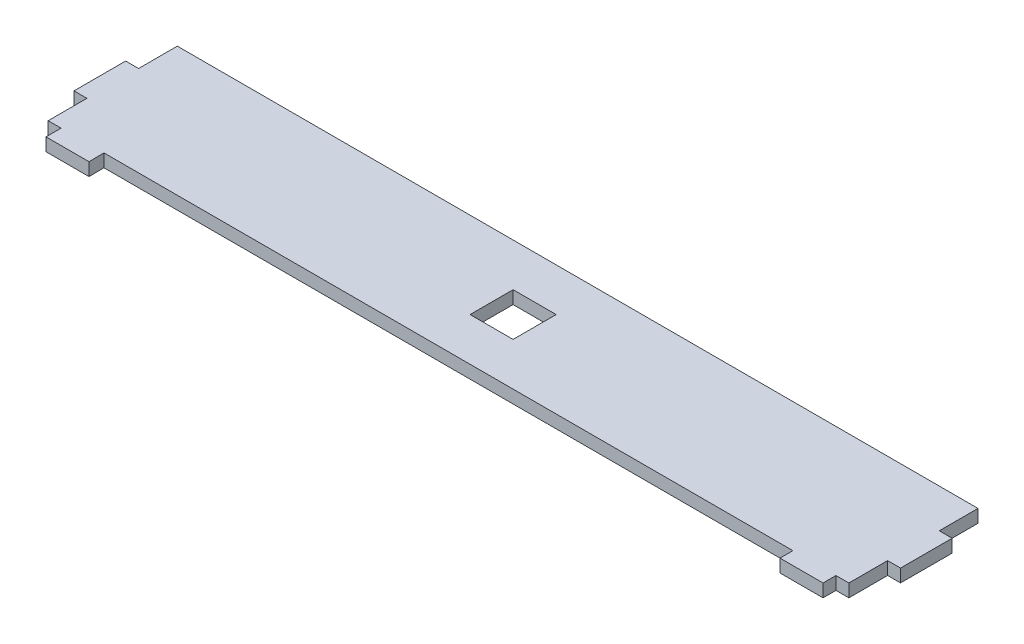
ISO-10303-21;
HEADER;
FILE_DESCRIPTION(('STEP AP214'),'2;1');
FILE_NAME('part.step','',(''),(''),'','','');
FILE_SCHEMA(('AUTOMOTIVE_DESIGN { 1 0 10303 214 1 1 1 1 }'));
ENDSEC;
DATA;
#1=APPLICATION_CONTEXT('core data for automotive mechanical design processes');
#2=APPLICATION_PROTOCOL_DEFINITION('international standard','automotive_design',2000,#1);
#3=PRODUCT_CONTEXT('',#1,'mechanical');
#4=PRODUCT('Part','Part','',(#3));
#5=PRODUCT_RELATED_PRODUCT_CATEGORY('part','',(#4));
#6=PRODUCT_DEFINITION_FORMATION('','',#4);
#7=PRODUCT_DEFINITION_CONTEXT('part definition',#1,'design');
#8=PRODUCT_DEFINITION('design','',#6,#7);
#9=PRODUCT_DEFINITION_SHAPE('','',#8);
#10=(LENGTH_UNIT() NAMED_UNIT(*) SI_UNIT(.MILLI.,.METRE.));
#11=(NAMED_UNIT(*) PLANE_ANGLE_UNIT() SI_UNIT($,.RADIAN.));
#12=(NAMED_UNIT(*) SI_UNIT($,.STERADIAN.) SOLID_ANGLE_UNIT());
#13=UNCERTAINTY_MEASURE_WITH_UNIT(LENGTH_MEASURE(1.E-05),#10,'distance_accuracy_value','');
#14=(GEOMETRIC_REPRESENTATION_CONTEXT(3) GLOBAL_UNCERTAINTY_ASSIGNED_CONTEXT((#13)) GLOBAL_UNIT_ASSIGNED_CONTEXT((#10,
#11,#12)) REPRESENTATION_CONTEXT('',''));
#15=CARTESIAN_POINT('',(0.,0.,0.));
#16=DIRECTION('',(0.,0.,1.));
#17=DIRECTION('',(1.,0.,0.));
#18=AXIS2_PLACEMENT_3D('',#15,#16,#17);
#19=CARTESIAN_POINT('',(0.,3.,-9.));
#20=DIRECTION('',(0.,0.,1.));
#21=DIRECTION('',(1.,0.,0.));
#22=AXIS2_PLACEMENT_3D('',#19,#20,#21);
#23=PLANE('',#22);
#24=DIRECTION('',(-1.,0.,0.));
#25=VECTOR('',#24,1.);
#26=CARTESIAN_POINT('',(0.,0.,-9.));
#27=LINE('',#26,#25);
#28=CARTESIAN_POINT('',(186.,0.,-9.));
#29=VERTEX_POINT('',#28);
#30=CARTESIAN_POINT('',(183.,0.,-9.));
#31=VERTEX_POINT('',#30);
#32=EDGE_CURVE('E262',#29,#31,#27,.T.);
#33=ORIENTED_EDGE('',*,*,#32,.F.);
#34=DIRECTION('',(0.,-1.,0.));
#35=VECTOR('',#34,1.);
#36=CARTESIAN_POINT('',(186.,3.,-9.));
#37=LINE('',#36,#35);
#38=CARTESIAN_POINT('',(186.,3.,-9.));
#39=VERTEX_POINT('',#38);
#40=EDGE_CURVE('E11',#39,#29,#37,.T.);
#41=ORIENTED_EDGE('',*,*,#40,.F.);
#42=DIRECTION('',(-1.,0.,0.));
#43=VECTOR('',#42,1.);
#44=CARTESIAN_POINT('',(0.,3.,-9.));
#45=LINE('',#44,#43);
#46=CARTESIAN_POINT('',(183.,3.,-9.));
#47=VERTEX_POINT('',#46);
#48=EDGE_CURVE('E426',#39,#47,#45,.T.);
#49=ORIENTED_EDGE('',*,*,#48,.T.);
#50=DIRECTION('',(0.,-1.,0.));
#51=VECTOR('',#50,1.);
#52=CARTESIAN_POINT('',(183.,3.,-9.));
#53=LINE('',#52,#51);
#54=EDGE_CURVE('E142',#47,#31,#53,.T.);
#55=ORIENTED_EDGE('',*,*,#54,.T.);
#56=EDGE_LOOP('',(#33,#41,#49,#55));
#57=FACE_BOUND('',#56,.T.);
#58=ADVANCED_FACE('F39',(#57),#23,.T.);
#59=CARTESIAN_POINT('',(186.,3.,0.));
#60=DIRECTION('',(1.,0.,0.));
#61=DIRECTION('',(0.,0.,-1.));
#62=AXIS2_PLACEMENT_3D('',#59,#60,#61);
#63=PLANE('',#62);
#64=DIRECTION('',(0.,0.,1.));
#65=VECTOR('',#64,1.);
#66=CARTESIAN_POINT('',(186.,0.,0.));
#67=LINE('',#66,#65);
#68=CARTESIAN_POINT('',(186.,0.,-21.));
#69=VERTEX_POINT('',#68);
#70=EDGE_CURVE('E265',#69,#29,#67,.T.);
#71=ORIENTED_EDGE('',*,*,#70,.F.);
#72=DIRECTION('',(0.,-1.,0.));
#73=VECTOR('',#72,1.);
#74=CARTESIAN_POINT('',(186.,3.,-21.));
#75=LINE('',#74,#73);
#76=CARTESIAN_POINT('',(186.,3.,-21.));
#77=VERTEX_POINT('',#76);
#78=EDGE_CURVE('E50',#77,#69,#75,.T.);
#79=ORIENTED_EDGE('',*,*,#78,.F.);
#80=DIRECTION('',(0.,0.,1.));
#81=VECTOR('',#80,1.);
#82=CARTESIAN_POINT('',(186.,3.,0.));
#83=LINE('',#82,#81);
#84=EDGE_CURVE('E429',#77,#39,#83,.T.);
#85=ORIENTED_EDGE('',*,*,#84,.T.);
#86=ORIENTED_EDGE('',*,*,#40,.T.);
#87=EDGE_LOOP('',(#71,#79,#85,#86));
#88=FACE_BOUND('',#87,.T.);
#89=ADVANCED_FACE('F504',(#88),#63,.T.);
#90=CARTESIAN_POINT('',(0.,3.,-21.));
#91=DIRECTION('',(0.,0.,-1.));
#92=DIRECTION('',(-1.,0.,0.));
#93=AXIS2_PLACEMENT_3D('',#90,#91,#92);
#94=PLANE('',#93);
#95=DIRECTION('',(1.,0.,0.));
#96=VECTOR('',#95,1.);
#97=CARTESIAN_POINT('',(0.,0.,-21.));
#98=LINE('',#97,#96);
#99=CARTESIAN_POINT('',(183.,0.,-21.));
#100=VERTEX_POINT('',#99);
#101=EDGE_CURVE('E269',#100,#69,#98,.T.);
#102=ORIENTED_EDGE('',*,*,#101,.F.);
#103=DIRECTION('',(0.,-1.,0.));
#104=VECTOR('',#103,1.);
#105=CARTESIAN_POINT('',(183.,3.,-21.));
#106=LINE('',#105,#104);
#107=CARTESIAN_POINT('',(183.,3.,-21.));
#108=VERTEX_POINT('',#107);
#109=EDGE_CURVE('E390',#108,#100,#106,.T.);
#110=ORIENTED_EDGE('',*,*,#109,.F.);
#111=DIRECTION('',(1.,0.,0.));
#112=VECTOR('',#111,1.);
#113=CARTESIAN_POINT('',(0.,3.,-21.));
#114=LINE('',#113,#112);
#115=EDGE_CURVE('E436',#108,#77,#114,.T.);
#116=ORIENTED_EDGE('',*,*,#115,.T.);
#117=ORIENTED_EDGE('',*,*,#78,.T.);
#118=EDGE_LOOP('',(#102,#110,#116,#117));
#119=FACE_BOUND('',#118,.T.);
#120=ADVANCED_FACE('F509',(#119),#94,.T.);
#121=CARTESIAN_POINT('',(183.,3.,0.));
#122=DIRECTION('',(-1.,0.,0.));
#123=DIRECTION('',(0.,0.,1.));
#124=AXIS2_PLACEMENT_3D('',#121,#122,#123);
#125=PLANE('',#124);
#126=DIRECTION('',(0.,0.,-1.));
#127=VECTOR('',#126,1.);
#128=CARTESIAN_POINT('',(183.,0.,0.));
#129=LINE('',#128,#127);
#130=CARTESIAN_POINT('',(183.,0.,-30.));
#131=VERTEX_POINT('',#130);
#132=EDGE_CURVE('E273',#100,#131,#129,.T.);
#133=ORIENTED_EDGE('',*,*,#132,.T.);
#134=DIRECTION('',(0.,-1.,0.));
#135=VECTOR('',#134,1.);
#136=CARTESIAN_POINT('',(183.,3.,-30.));
#137=LINE('',#136,#135);
#138=CARTESIAN_POINT('',(183.,3.,-30.));
#139=VERTEX_POINT('',#138);
#140=EDGE_CURVE('E386',#139,#131,#137,.T.);
#141=ORIENTED_EDGE('',*,*,#140,.F.);
#142=DIRECTION('',(0.,0.,-1.));
#143=VECTOR('',#142,1.);
#144=CARTESIAN_POINT('',(183.,3.,0.));
#145=LINE('',#144,#143);
#146=EDGE_CURVE('E440',#108,#139,#145,.T.);
#147=ORIENTED_EDGE('',*,*,#146,.F.);
#148=ORIENTED_EDGE('',*,*,#109,.T.);
#149=EDGE_LOOP('',(#133,#141,#147,#148));
#150=FACE_BOUND('',#149,.T.);
#151=ADVANCED_FACE('F577',(#150),#125,.F.);
#152=CARTESIAN_POINT('',(0.,3.,-30.));
#153=DIRECTION('',(0.,0.,1.));
#154=DIRECTION('',(1.,0.,0.));
#155=AXIS2_PLACEMENT_3D('',#152,#153,#154);
#156=PLANE('',#155);
#157=DIRECTION('',(-1.,0.,0.));
#158=VECTOR('',#157,1.);
#159=CARTESIAN_POINT('',(0.,0.,-30.));
#160=LINE('',#159,#158);
#161=CARTESIAN_POINT('',(-3.,0.,-30.));
#162=VERTEX_POINT('',#161);
#163=EDGE_CURVE('E277',#131,#162,#160,.T.);
#164=ORIENTED_EDGE('',*,*,#163,.T.);
#165=DIRECTION('',(0.,-1.,0.));
#166=VECTOR('',#165,1.);
#167=CARTESIAN_POINT('',(-3.,3.,-30.));
#168=LINE('',#167,#166);
#169=CARTESIAN_POINT('',(-3.,3.,-30.));
#170=VERTEX_POINT('',#169);
#171=EDGE_CURVE('E383',#170,#162,#168,.T.);
#172=ORIENTED_EDGE('',*,*,#171,.F.);
#173=DIRECTION('',(-1.,0.,0.));
#174=VECTOR('',#173,1.);
#175=CARTESIAN_POINT('',(0.,3.,-30.));
#176=LINE('',#175,#174);
#177=EDGE_CURVE('E444',#139,#170,#176,.T.);
#178=ORIENTED_EDGE('',*,*,#177,.F.);
#179=ORIENTED_EDGE('',*,*,#140,.T.);
#180=EDGE_LOOP('',(#164,#172,#178,#179));
#181=FACE_BOUND('',#180,.T.);
#182=ADVANCED_FACE('F573',(#181),#156,.F.);
#183=CARTESIAN_POINT('',(-3.,3.,0.));
#184=DIRECTION('',(-1.,0.,0.));
#185=DIRECTION('',(0.,0.,1.));
#186=AXIS2_PLACEMENT_3D('',#183,#184,#185);
#187=PLANE('',#186);
#188=DIRECTION('',(0.,0.,-1.));
#189=VECTOR('',#188,1.);
#190=CARTESIAN_POINT('',(-3.,0.,0.));
#191=LINE('',#190,#189);
#192=CARTESIAN_POINT('',(-3.,0.,-21.));
#193=VERTEX_POINT('',#192);
#194=EDGE_CURVE('E281',#193,#162,#191,.T.);
#195=ORIENTED_EDGE('',*,*,#194,.F.);
#196=DIRECTION('',(0.,-1.,0.));
#197=VECTOR('',#196,1.);
#198=CARTESIAN_POINT('',(-3.,3.,-21.));
#199=LINE('',#198,#197);
#200=CARTESIAN_POINT('',(-3.,3.,-21.));
#201=VERTEX_POINT('',#200);
#202=EDGE_CURVE('E380',#201,#193,#199,.T.);
#203=ORIENTED_EDGE('',*,*,#202,.F.);
#204=DIRECTION('',(0.,0.,-1.));
#205=VECTOR('',#204,1.);
#206=CARTESIAN_POINT('',(-3.,3.,0.));
#207=LINE('',#206,#205);
#208=EDGE_CURVE('E447',#201,#170,#207,.T.);
#209=ORIENTED_EDGE('',*,*,#208,.T.);
#210=ORIENTED_EDGE('',*,*,#171,.T.);
#211=EDGE_LOOP('',(#195,#203,#209,#210));
#212=FACE_BOUND('',#211,.T.);
#213=ADVANCED_FACE('F569',(#212),#187,.T.);
#214=CARTESIAN_POINT('',(0.,3.,-21.));
#215=DIRECTION('',(0.,0.,1.));
#216=DIRECTION('',(1.,0.,0.));
#217=AXIS2_PLACEMENT_3D('',#214,#215,#216);
#218=PLANE('',#217);
#219=DIRECTION('',(-1.,0.,0.));
#220=VECTOR('',#219,1.);
#221=CARTESIAN_POINT('',(0.,0.,-21.));
#222=LINE('',#221,#220);
#223=CARTESIAN_POINT('',(-6.,0.,-21.));
#224=VERTEX_POINT('',#223);
#225=EDGE_CURVE('E285',#193,#224,#222,.T.);
#226=ORIENTED_EDGE('',*,*,#225,.T.);
#227=DIRECTION('',(0.,-1.,0.));
#228=VECTOR('',#227,1.);
#229=CARTESIAN_POINT('',(-6.,3.,-21.));
#230=LINE('',#229,#228);
#231=CARTESIAN_POINT('',(-6.,3.,-21.));
#232=VERTEX_POINT('',#231);
#233=EDGE_CURVE('E376',#232,#224,#230,.T.);
#234=ORIENTED_EDGE('',*,*,#233,.F.);
#235=DIRECTION('',(-1.,0.,0.));
#236=VECTOR('',#235,1.);
#237=CARTESIAN_POINT('',(0.,3.,-21.));
#238=LINE('',#237,#236);
#239=EDGE_CURVE('E451',#201,#232,#238,.T.);
#240=ORIENTED_EDGE('',*,*,#239,.F.);
#241=ORIENTED_EDGE('',*,*,#202,.T.);
#242=EDGE_LOOP('',(#226,#234,#240,#241));
#243=FACE_BOUND('',#242,.T.);
#244=ADVANCED_FACE('F565',(#243),#218,.F.);
#245=CARTESIAN_POINT('',(-6.,3.,0.));
#246=DIRECTION('',(1.,0.,0.));
#247=DIRECTION('',(0.,0.,-1.));
#248=AXIS2_PLACEMENT_3D('',#245,#246,#247);
#249=PLANE('',#248);
#250=DIRECTION('',(0.,0.,1.));
#251=VECTOR('',#250,1.);
#252=CARTESIAN_POINT('',(-6.,0.,0.));
#253=LINE('',#252,#251);
#254=CARTESIAN_POINT('',(-6.,0.,-9.));
#255=VERTEX_POINT('',#254);
#256=EDGE_CURVE('E289',#224,#255,#253,.T.);
#257=ORIENTED_EDGE('',*,*,#256,.T.);
#258=DIRECTION('',(0.,-1.,0.));
#259=VECTOR('',#258,1.);
#260=CARTESIAN_POINT('',(-6.,3.,-9.));
#261=LINE('',#260,#259);
#262=CARTESIAN_POINT('',(-6.,3.,-9.));
#263=VERTEX_POINT('',#262);
#264=EDGE_CURVE('E372',#263,#255,#261,.T.);
#265=ORIENTED_EDGE('',*,*,#264,.F.);
#266=DIRECTION('',(0.,0.,1.));
#267=VECTOR('',#266,1.);
#268=CARTESIAN_POINT('',(-6.,3.,0.));
#269=LINE('',#268,#267);
#270=EDGE_CURVE('E455',#232,#263,#269,.T.);
#271=ORIENTED_EDGE('',*,*,#270,.F.);
#272=ORIENTED_EDGE('',*,*,#233,.T.);
#273=EDGE_LOOP('',(#257,#265,#271,#272));
#274=FACE_BOUND('',#273,.T.);
#275=ADVANCED_FACE('F561',(#274),#249,.F.);
#276=CARTESIAN_POINT('',(0.,3.,-9.));
#277=DIRECTION('',(0.,0.,-1.));
#278=DIRECTION('',(-1.,0.,0.));
#279=AXIS2_PLACEMENT_3D('',#276,#277,#278);
#280=PLANE('',#279);
#281=DIRECTION('',(1.,0.,0.));
#282=VECTOR('',#281,1.);
#283=CARTESIAN_POINT('',(0.,0.,-9.));
#284=LINE('',#283,#282);
#285=CARTESIAN_POINT('',(-3.,0.,-9.));
#286=VERTEX_POINT('',#285);
#287=EDGE_CURVE('E293',#255,#286,#284,.T.);
#288=ORIENTED_EDGE('',*,*,#287,.T.);
#289=DIRECTION('',(0.,-1.,0.));
#290=VECTOR('',#289,1.);
#291=CARTESIAN_POINT('',(-3.,3.,-9.));
#292=LINE('',#291,#290);
#293=CARTESIAN_POINT('',(-3.,3.,-9.));
#294=VERTEX_POINT('',#293);
#295=EDGE_CURVE('E368',#294,#286,#292,.T.);
#296=ORIENTED_EDGE('',*,*,#295,.F.);
#297=DIRECTION('',(1.,0.,0.));
#298=VECTOR('',#297,1.);
#299=CARTESIAN_POINT('',(0.,3.,-9.));
#300=LINE('',#299,#298);
#301=EDGE_CURVE('E459',#263,#294,#300,.T.);
#302=ORIENTED_EDGE('',*,*,#301,.F.);
#303=ORIENTED_EDGE('',*,*,#264,.T.);
#304=EDGE_LOOP('',(#288,#296,#302,#303));
#305=FACE_BOUND('',#304,.T.);
#306=ADVANCED_FACE('F557',(#305),#280,.F.);
#307=CARTESIAN_POINT('',(-3.,3.,0.));
#308=DIRECTION('',(1.,0.,0.));
#309=DIRECTION('',(0.,0.,-1.));
#310=AXIS2_PLACEMENT_3D('',#307,#308,#309);
#311=PLANE('',#310);
#312=DIRECTION('',(0.,0.,1.));
#313=VECTOR('',#312,1.);
#314=CARTESIAN_POINT('',(-3.,0.,0.));
#315=LINE('',#314,#313);
#316=CARTESIAN_POINT('',(-3.,0.,0.));
#317=VERTEX_POINT('',#316);
#318=EDGE_CURVE('E297',#286,#317,#315,.T.);
#319=ORIENTED_EDGE('',*,*,#318,.T.);
#320=DIRECTION('',(0.,-1.,0.));
#321=VECTOR('',#320,1.);
#322=CARTESIAN_POINT('',(-3.,3.,0.));
#323=LINE('',#322,#321);
#324=CARTESIAN_POINT('',(-3.,3.,0.));
#325=VERTEX_POINT('',#324);
#326=EDGE_CURVE('E364',#325,#317,#323,.T.);
#327=ORIENTED_EDGE('',*,*,#326,.F.);
#328=DIRECTION('',(0.,0.,1.));
#329=VECTOR('',#328,1.);
#330=CARTESIAN_POINT('',(-3.,3.,0.));
#331=LINE('',#330,#329);
#332=EDGE_CURVE('E463',#294,#325,#331,.T.);
#333=ORIENTED_EDGE('',*,*,#332,.F.);
#334=ORIENTED_EDGE('',*,*,#295,.T.);
#335=EDGE_LOOP('',(#319,#327,#333,#334));
#336=FACE_BOUND('',#335,.T.);
#337=ADVANCED_FACE('F553',(#336),#311,.F.);
#338=CARTESIAN_POINT('',(0.,3.,0.));
#339=DIRECTION('',(0.,0.,-1.));
#340=DIRECTION('',(-1.,0.,0.));
#341=AXIS2_PLACEMENT_3D('',#338,#339,#340);
#342=PLANE('',#341);
#343=DIRECTION('',(1.,0.,0.));
#344=VECTOR('',#343,1.);
#345=CARTESIAN_POINT('',(0.,0.,0.));
#346=LINE('',#345,#344);
#347=CARTESIAN_POINT('',(0.,0.,0.));
#348=VERTEX_POINT('',#347);
#349=EDGE_CURVE('E301',#317,#348,#346,.T.);
#350=ORIENTED_EDGE('',*,*,#349,.T.);
#351=DIRECTION('',(0.,-1.,0.));
#352=VECTOR('',#351,1.);
#353=CARTESIAN_POINT('',(0.,3.,0.));
#354=LINE('',#353,#352);
#355=CARTESIAN_POINT('',(0.,3.,0.));
#356=VERTEX_POINT('',#355);
#357=EDGE_CURVE('E360',#356,#348,#354,.T.);
#358=ORIENTED_EDGE('',*,*,#357,.F.);
#359=DIRECTION('',(1.,0.,0.));
#360=VECTOR('',#359,1.);
#361=CARTESIAN_POINT('',(0.,3.,0.));
#362=LINE('',#361,#360);
#363=EDGE_CURVE('E467',#325,#356,#362,.T.);
#364=ORIENTED_EDGE('',*,*,#363,.F.);
#365=ORIENTED_EDGE('',*,*,#326,.T.);
#366=EDGE_LOOP('',(#350,#358,#364,#365));
#367=FACE_BOUND('',#366,.T.);
#368=ADVANCED_FACE('F549',(#367),#342,.F.);
#369=CARTESIAN_POINT('',(0.,3.,0.));
#370=DIRECTION('',(1.,0.,0.));
#371=DIRECTION('',(0.,0.,-1.));
#372=AXIS2_PLACEMENT_3D('',#369,#370,#371);
#373=PLANE('',#372);
#374=DIRECTION('',(0.,0.,1.));
#375=VECTOR('',#374,1.);
#376=CARTESIAN_POINT('',(0.,0.,0.));
#377=LINE('',#376,#375);
#378=CARTESIAN_POINT('',(0.,0.,3.50479653710962));
#379=VERTEX_POINT('',#378);
#380=EDGE_CURVE('E305',#348,#379,#377,.T.);
#381=ORIENTED_EDGE('',*,*,#380,.T.);
#382=DIRECTION('',(0.,-1.,0.));
#383=VECTOR('',#382,1.);
#384=CARTESIAN_POINT('',(0.,3.,3.50479653710962));
#385=LINE('',#384,#383);
#386=CARTESIAN_POINT('',(0.,3.,3.50479653710962));
#387=VERTEX_POINT('',#386);
#388=EDGE_CURVE('E356',#387,#379,#385,.T.);
#389=ORIENTED_EDGE('',*,*,#388,.F.);
#390=DIRECTION('',(0.,0.,1.));
#391=VECTOR('',#390,1.);
#392=CARTESIAN_POINT('',(0.,3.,0.));
#393=LINE('',#392,#391);
#394=EDGE_CURVE('E471',#356,#387,#393,.T.);
#395=ORIENTED_EDGE('',*,*,#394,.F.);
#396=ORIENTED_EDGE('',*,*,#357,.T.);
#397=EDGE_LOOP('',(#381,#389,#395,#396));
#398=FACE_BOUND('',#397,.T.);
#399=ADVANCED_FACE('F545',(#398),#373,.F.);
#400=CARTESIAN_POINT('',(0.,3.,3.50479653710962));
#401=DIRECTION('',(0.,0.,-1.));
#402=DIRECTION('',(-1.,0.,0.));
#403=AXIS2_PLACEMENT_3D('',#400,#401,#402);
#404=PLANE('',#403);
#405=DIRECTION('',(1.,0.,0.));
#406=VECTOR('',#405,1.);
#407=CARTESIAN_POINT('',(0.,0.,3.50479653710962));
#408=LINE('',#407,#406);
#409=CARTESIAN_POINT('',(10.,0.,3.50479653710962));
#410=VERTEX_POINT('',#409);
#411=EDGE_CURVE('E309',#379,#410,#408,.T.);
#412=ORIENTED_EDGE('',*,*,#411,.T.);
#413=DIRECTION('',(0.,-1.,0.));
#414=VECTOR('',#413,1.);
#415=CARTESIAN_POINT('',(10.,3.,3.50479653710962));
#416=LINE('',#415,#414);
#417=CARTESIAN_POINT('',(10.,3.,3.50479653710962));
#418=VERTEX_POINT('',#417);
#419=EDGE_CURVE('E352',#418,#410,#416,.T.);
#420=ORIENTED_EDGE('',*,*,#419,.F.);
#421=DIRECTION('',(1.,0.,0.));
#422=VECTOR('',#421,1.);
#423=CARTESIAN_POINT('',(0.,3.,3.50479653710962));
#424=LINE('',#423,#422);
#425=EDGE_CURVE('E475',#387,#418,#424,.T.);
#426=ORIENTED_EDGE('',*,*,#425,.F.);
#427=ORIENTED_EDGE('',*,*,#388,.T.);
#428=EDGE_LOOP('',(#412,#420,#426,#427));
#429=FACE_BOUND('',#428,.T.);
#430=ADVANCED_FACE('F541',(#429),#404,.F.);
#431=CARTESIAN_POINT('',(9.94797535405886,3.,-0.141919441666993));
#432=DIRECTION('',(-0.999898253821791,0.,0.0142647118489585));
#433=DIRECTION('',(0.0142647118489585,0.,0.999898253821791));
#434=AXIS2_PLACEMENT_3D('',#431,#432,#433);
#435=PLANE('',#434);
#436=DIRECTION('',(-0.0142647118489585,0.,-0.999898253821791));
#437=VECTOR('',#436,1.);
#438=CARTESIAN_POINT('',(9.94797535405886,0.,-0.141919441666993));
#439=LINE('',#438,#437);
#440=CARTESIAN_POINT('',(9.94999999999999,0.,0.));
#441=VERTEX_POINT('',#440);
#442=EDGE_CURVE('E313',#410,#441,#439,.T.);
#443=ORIENTED_EDGE('',*,*,#442,.T.);
#444=DIRECTION('',(0.,-1.,0.));
#445=VECTOR('',#444,1.);
#446=CARTESIAN_POINT('',(9.94999999999999,3.,0.));
#447=LINE('',#446,#445);
#448=CARTESIAN_POINT('',(9.94999999999999,3.,0.));
#449=VERTEX_POINT('',#448);
#450=EDGE_CURVE('E349',#449,#441,#447,.T.);
#451=ORIENTED_EDGE('',*,*,#450,.F.);
#452=DIRECTION('',(-0.0142647118489585,0.,-0.999898253821791));
#453=VECTOR('',#452,1.);
#454=CARTESIAN_POINT('',(9.94797535405886,3.,-0.141919441666993));
#455=LINE('',#454,#453);
#456=EDGE_CURVE('E479',#418,#449,#455,.T.);
#457=ORIENTED_EDGE('',*,*,#456,.F.);
#458=ORIENTED_EDGE('',*,*,#419,.T.);
#459=EDGE_LOOP('',(#443,#451,#457,#458));
#460=FACE_BOUND('',#459,.T.);
#461=ADVANCED_FACE('F537',(#460),#435,.F.);
#462=CARTESIAN_POINT('',(0.,3.,0.));
#463=DIRECTION('',(0.,0.,1.));
#464=DIRECTION('',(1.,0.,0.));
#465=AXIS2_PLACEMENT_3D('',#462,#463,#464);
#466=PLANE('',#465);
#467=DIRECTION('',(-1.,0.,0.));
#468=VECTOR('',#467,1.);
#469=CARTESIAN_POINT('',(0.,0.,0.));
#470=LINE('',#469,#468);
#471=CARTESIAN_POINT('',(170.,0.,0.));
#472=VERTEX_POINT('',#471);
#473=EDGE_CURVE('E317',#472,#441,#470,.T.);
#474=ORIENTED_EDGE('',*,*,#473,.F.);
#475=DIRECTION('',(0.,-1.,0.));
#476=VECTOR('',#475,1.);
#477=CARTESIAN_POINT('',(170.,3.,0.));
#478=LINE('',#477,#476);
#479=CARTESIAN_POINT('',(170.,3.,0.));
#480=VERTEX_POINT('',#479);
#481=EDGE_CURVE('E346',#480,#472,#478,.T.);
#482=ORIENTED_EDGE('',*,*,#481,.F.);
#483=DIRECTION('',(-1.,0.,0.));
#484=VECTOR('',#483,1.);
#485=CARTESIAN_POINT('',(0.,3.,0.));
#486=LINE('',#485,#484);
#487=EDGE_CURVE('E482',#480,#449,#486,.T.);
#488=ORIENTED_EDGE('',*,*,#487,.T.);
#489=ORIENTED_EDGE('',*,*,#450,.T.);
#490=EDGE_LOOP('',(#474,#482,#488,#489));
#491=FACE_BOUND('',#490,.T.);
#492=ADVANCED_FACE('F534',(#491),#466,.T.);
#493=CARTESIAN_POINT('',(170.,3.,0.));
#494=DIRECTION('',(-1.,0.,0.));
#495=DIRECTION('',(0.,0.,1.));
#496=AXIS2_PLACEMENT_3D('',#493,#494,#495);
#497=PLANE('',#496);
#498=DIRECTION('',(0.,0.,-1.));
#499=VECTOR('',#498,1.);
#500=CARTESIAN_POINT('',(170.,0.,0.));
#501=LINE('',#500,#499);
#502=CARTESIAN_POINT('',(170.,0.,3.));
#503=VERTEX_POINT('',#502);
#504=EDGE_CURVE('E321',#503,#472,#501,.T.);
#505=ORIENTED_EDGE('',*,*,#504,.F.);
#506=DIRECTION('',(0.,-1.,0.));
#507=VECTOR('',#506,1.);
#508=CARTESIAN_POINT('',(170.,3.,3.));
#509=LINE('',#508,#507);
#510=CARTESIAN_POINT('',(170.,3.,3.));
#511=VERTEX_POINT('',#510);
#512=EDGE_CURVE('E343',#511,#503,#509,.T.);
#513=ORIENTED_EDGE('',*,*,#512,.F.);
#514=DIRECTION('',(0.,0.,-1.));
#515=VECTOR('',#514,1.);
#516=CARTESIAN_POINT('',(170.,3.,0.));
#517=LINE('',#516,#515);
#518=EDGE_CURVE('E239',#511,#480,#517,.T.);
#519=ORIENTED_EDGE('',*,*,#518,.T.);
#520=ORIENTED_EDGE('',*,*,#481,.T.);
#521=EDGE_LOOP('',(#505,#513,#519,#520));
#522=FACE_BOUND('',#521,.T.);
#523=ADVANCED_FACE('F489',(#522),#497,.T.);
#524=CARTESIAN_POINT('',(0.,3.,3.));
#525=DIRECTION('',(0.,0.,1.));
#526=DIRECTION('',(1.,0.,0.));
#527=AXIS2_PLACEMENT_3D('',#524,#525,#526);
#528=PLANE('',#527);
#529=DIRECTION('',(-1.,0.,0.));
#530=VECTOR('',#529,1.);
#531=CARTESIAN_POINT('',(0.,0.,3.));
#532=LINE('',#531,#530);
#533=CARTESIAN_POINT('',(180.,0.,3.));
#534=VERTEX_POINT('',#533);
#535=EDGE_CURVE('E325',#534,#503,#532,.T.);
#536=ORIENTED_EDGE('',*,*,#535,.F.);
#537=DIRECTION('',(0.,-1.,0.));
#538=VECTOR('',#537,1.);
#539=CARTESIAN_POINT('',(180.,3.,3.));
#540=LINE('',#539,#538);
#541=CARTESIAN_POINT('',(180.,3.,3.));
#542=VERTEX_POINT('',#541);
#543=EDGE_CURVE('E223',#542,#534,#540,.T.);
#544=ORIENTED_EDGE('',*,*,#543,.F.);
#545=DIRECTION('',(-1.,0.,0.));
#546=VECTOR('',#545,1.);
#547=CARTESIAN_POINT('',(0.,3.,3.));
#548=LINE('',#547,#546);
#549=EDGE_CURVE('E235',#542,#511,#548,.T.);
#550=ORIENTED_EDGE('',*,*,#549,.T.);
#551=ORIENTED_EDGE('',*,*,#512,.T.);
#552=EDGE_LOOP('',(#536,#544,#550,#551));
#553=FACE_BOUND('',#552,.T.);
#554=ADVANCED_FACE('F494',(#553),#528,.T.);
#555=CARTESIAN_POINT('',(180.,3.,0.));
#556=DIRECTION('',(1.,0.,0.));
#557=DIRECTION('',(0.,0.,-1.));
#558=AXIS2_PLACEMENT_3D('',#555,#556,#557);
#559=PLANE('',#558);
#560=DIRECTION('',(0.,0.,1.));
#561=VECTOR('',#560,1.);
#562=CARTESIAN_POINT('',(180.,0.,0.));
#563=LINE('',#562,#561);
#564=CARTESIAN_POINT('',(180.,0.,0.));
#565=VERTEX_POINT('',#564);
#566=EDGE_CURVE('E219',#565,#534,#563,.T.);
#567=ORIENTED_EDGE('',*,*,#566,.F.);
#568=DIRECTION('',(0.,-1.,0.));
#569=VECTOR('',#568,1.);
#570=CARTESIAN_POINT('',(180.,3.,0.));
#571=LINE('',#570,#569);
#572=CARTESIAN_POINT('',(180.,3.,0.));
#573=VERTEX_POINT('',#572);
#574=EDGE_CURVE('E213',#573,#565,#571,.T.);
#575=ORIENTED_EDGE('',*,*,#574,.F.);
#576=DIRECTION('',(0.,0.,1.));
#577=VECTOR('',#576,1.);
#578=CARTESIAN_POINT('',(180.,3.,0.));
#579=LINE('',#578,#577);
#580=EDGE_CURVE('E217',#573,#542,#579,.T.);
#581=ORIENTED_EDGE('',*,*,#580,.T.);
#582=ORIENTED_EDGE('',*,*,#543,.T.);
#583=EDGE_LOOP('',(#567,#575,#581,#582));
#584=FACE_BOUND('',#583,.T.);
#585=ADVANCED_FACE('F215',(#584),#559,.T.);
#586=CARTESIAN_POINT('',(0.,3.,0.));
#587=DIRECTION('',(0.,0.,-1.));
#588=DIRECTION('',(-1.,0.,0.));
#589=AXIS2_PLACEMENT_3D('',#586,#587,#588);
#590=PLANE('',#589);
#591=DIRECTION('',(1.,0.,0.));
#592=VECTOR('',#591,1.);
#593=CARTESIAN_POINT('',(0.,0.,0.));
#594=LINE('',#593,#592);
#595=CARTESIAN_POINT('',(183.,0.,0.));
#596=VERTEX_POINT('',#595);
#597=EDGE_CURVE('E331',#565,#596,#594,.T.);
#598=ORIENTED_EDGE('',*,*,#597,.T.);
#599=DIRECTION('',(0.,-1.,0.));
#600=VECTOR('',#599,1.);
#601=CARTESIAN_POINT('',(183.,3.,0.));
#602=LINE('',#601,#600);
#603=CARTESIAN_POINT('',(183.,3.,0.));
#604=VERTEX_POINT('',#603);
#605=EDGE_CURVE('E224',#604,#596,#602,.T.);
#606=ORIENTED_EDGE('',*,*,#605,.F.);
#607=DIRECTION('',(1.,0.,0.));
#608=VECTOR('',#607,1.);
#609=CARTESIAN_POINT('',(0.,3.,0.));
#610=LINE('',#609,#608);
#611=EDGE_CURVE('E227',#573,#604,#610,.T.);
#612=ORIENTED_EDGE('',*,*,#611,.F.);
#613=ORIENTED_EDGE('',*,*,#574,.T.);
#614=EDGE_LOOP('',(#598,#606,#612,#613));
#615=FACE_BOUND('',#614,.T.);
#616=ADVANCED_FACE('F228',(#615),#590,.F.);
#617=CARTESIAN_POINT('',(84.9999999999999,3.,0.));
#618=DIRECTION('',(1.,0.,0.));
#619=DIRECTION('',(0.,0.,-1.));
#620=AXIS2_PLACEMENT_3D('',#617,#618,#619);
#621=PLANE('',#620);
#622=DIRECTION('',(0.,0.,1.));
#623=VECTOR('',#622,1.);
#624=CARTESIAN_POINT('',(84.9999999999999,0.,0.));
#625=LINE('',#624,#623);
#626=CARTESIAN_POINT('',(84.9999999999999,0.,-20.));
#627=VERTEX_POINT('',#626);
#628=CARTESIAN_POINT('',(84.9999999999999,0.,-10.));
#629=VERTEX_POINT('',#628);
#630=EDGE_CURVE('E246',#627,#629,#625,.T.);
#631=ORIENTED_EDGE('',*,*,#630,.F.);
#632=DIRECTION('',(0.,-1.,0.));
#633=VECTOR('',#632,1.);
#634=CARTESIAN_POINT('',(84.9999999999999,3.,-20.));
#635=LINE('',#634,#633);
#636=CARTESIAN_POINT('',(84.9999999999999,3.,-20.));
#637=VERTEX_POINT('',#636);
#638=EDGE_CURVE('E43',#637,#627,#635,.T.);
#639=ORIENTED_EDGE('',*,*,#638,.F.);
#640=DIRECTION('',(0.,0.,1.));
#641=VECTOR('',#640,1.);
#642=CARTESIAN_POINT('',(84.9999999999999,3.,0.));
#643=LINE('',#642,#641);
#644=CARTESIAN_POINT('',(84.9999999999999,3.,-10.));
#645=VERTEX_POINT('',#644);
#646=EDGE_CURVE('E336',#637,#645,#643,.T.);
#647=ORIENTED_EDGE('',*,*,#646,.T.);
#648=DIRECTION('',(0.,-1.,0.));
#649=VECTOR('',#648,1.);
#650=CARTESIAN_POINT('',(84.9999999999999,3.,-10.));
#651=LINE('',#650,#649);
#652=EDGE_CURVE('E245',#645,#629,#651,.T.);
#653=ORIENTED_EDGE('',*,*,#652,.T.);
#654=EDGE_LOOP('',(#631,#639,#647,#653));
#655=FACE_BOUND('',#654,.T.);
#656=ADVANCED_FACE('F41',(#655),#621,.T.);
#657=CARTESIAN_POINT('',(0.,3.,-20.));
#658=DIRECTION('',(0.,0.,1.));
#659=DIRECTION('',(1.,0.,0.));
#660=AXIS2_PLACEMENT_3D('',#657,#658,#659);
#661=PLANE('',#660);
#662=DIRECTION('',(-1.,0.,0.));
#663=VECTOR('',#662,1.);
#664=CARTESIAN_POINT('',(0.,0.,-20.));
#665=LINE('',#664,#663);
#666=CARTESIAN_POINT('',(94.9999999999999,0.,-20.));
#667=VERTEX_POINT('',#666);
#668=EDGE_CURVE('E250',#667,#627,#665,.T.);
#669=ORIENTED_EDGE('',*,*,#668,.F.);
#670=DIRECTION('',(0.,-1.,0.));
#671=VECTOR('',#670,1.);
#672=CARTESIAN_POINT('',(94.9999999999999,3.,-20.));
#673=LINE('',#672,#671);
#674=CARTESIAN_POINT('',(94.9999999999999,3.,-20.));
#675=VERTEX_POINT('',#674);
#676=EDGE_CURVE('E399',#675,#667,#673,.T.);
#677=ORIENTED_EDGE('',*,*,#676,.F.);
#678=DIRECTION('',(-1.,0.,0.));
#679=VECTOR('',#678,1.);
#680=CARTESIAN_POINT('',(0.,3.,-20.));
#681=LINE('',#680,#679);
#682=EDGE_CURVE('E410',#675,#637,#681,.T.);
#683=ORIENTED_EDGE('',*,*,#682,.T.);
#684=ORIENTED_EDGE('',*,*,#638,.T.);
#685=EDGE_LOOP('',(#669,#677,#683,#684));
#686=FACE_BOUND('',#685,.T.);
#687=ADVANCED_FACE('F408',(#686),#661,.T.);
#688=CARTESIAN_POINT('',(94.9999999999999,3.,0.));
#689=DIRECTION('',(-1.,0.,0.));
#690=DIRECTION('',(0.,0.,1.));
#691=AXIS2_PLACEMENT_3D('',#688,#689,#690);
#692=PLANE('',#691);
#693=DIRECTION('',(0.,0.,-1.));
#694=VECTOR('',#693,1.);
#695=CARTESIAN_POINT('',(94.9999999999999,0.,0.));
#696=LINE('',#695,#694);
#697=CARTESIAN_POINT('',(94.9999999999999,0.,-10.));
#698=VERTEX_POINT('',#697);
#699=EDGE_CURVE('E254',#698,#667,#696,.T.);
#700=ORIENTED_EDGE('',*,*,#699,.F.);
#701=DIRECTION('',(0.,-1.,0.));
#702=VECTOR('',#701,1.);
#703=CARTESIAN_POINT('',(94.9999999999999,3.,-10.));
#704=LINE('',#703,#702);
#705=CARTESIAN_POINT('',(94.9999999999999,3.,-10.));
#706=VERTEX_POINT('',#705);
#707=EDGE_CURVE('E397',#706,#698,#704,.T.);
#708=ORIENTED_EDGE('',*,*,#707,.F.);
#709=DIRECTION('',(0.,0.,-1.));
#710=VECTOR('',#709,1.);
#711=CARTESIAN_POINT('',(94.9999999999999,3.,0.));
#712=LINE('',#711,#710);
#713=EDGE_CURVE('E416',#706,#675,#712,.T.);
#714=ORIENTED_EDGE('',*,*,#713,.T.);
#715=ORIENTED_EDGE('',*,*,#676,.T.);
#716=EDGE_LOOP('',(#700,#708,#714,#715));
#717=FACE_BOUND('',#716,.T.);
#718=ADVANCED_FACE('F414',(#717),#692,.T.);
#719=CARTESIAN_POINT('',(0.,3.,-10.));
#720=DIRECTION('',(0.,0.,-1.));
#721=DIRECTION('',(-1.,0.,0.));
#722=AXIS2_PLACEMENT_3D('',#719,#720,#721);
#723=PLANE('',#722);
#724=DIRECTION('',(1.,0.,0.));
#725=VECTOR('',#724,1.);
#726=CARTESIAN_POINT('',(0.,0.,-10.));
#727=LINE('',#726,#725);
#728=EDGE_CURVE('E258',#629,#698,#727,.T.);
#729=ORIENTED_EDGE('',*,*,#728,.F.);
#730=ORIENTED_EDGE('',*,*,#652,.F.);
#731=DIRECTION('',(1.,0.,0.));
#732=VECTOR('',#731,1.);
#733=CARTESIAN_POINT('',(0.,3.,-10.));
#734=LINE('',#733,#732);
#735=EDGE_CURVE('E421',#645,#706,#734,.T.);
#736=ORIENTED_EDGE('',*,*,#735,.T.);
#737=ORIENTED_EDGE('',*,*,#707,.T.);
#738=EDGE_LOOP('',(#729,#730,#736,#737));
#739=FACE_BOUND('',#738,.T.);
#740=ADVANCED_FACE('F424',(#739),#723,.T.);
#741=CARTESIAN_POINT('',(183.,3.,0.));
#742=DIRECTION('',(-1.,0.,0.));
#743=DIRECTION('',(0.,0.,1.));
#744=AXIS2_PLACEMENT_3D('',#741,#742,#743);
#745=PLANE('',#744);
#746=DIRECTION('',(0.,0.,-1.));
#747=VECTOR('',#746,1.);
#748=CARTESIAN_POINT('',(183.,0.,0.));
#749=LINE('',#748,#747);
#750=EDGE_CURVE('E135',#596,#31,#749,.T.);
#751=ORIENTED_EDGE('',*,*,#750,.T.);
#752=ORIENTED_EDGE('',*,*,#54,.F.);
#753=DIRECTION('',(0.,0.,-1.));
#754=VECTOR('',#753,1.);
#755=CARTESIAN_POINT('',(183.,3.,0.));
#756=LINE('',#755,#754);
#757=EDGE_CURVE('E59',#604,#47,#756,.T.);
#758=ORIENTED_EDGE('',*,*,#757,.F.);
#759=ORIENTED_EDGE('',*,*,#605,.T.);
#760=EDGE_LOOP('',(#751,#752,#758,#759));
#761=FACE_BOUND('',#760,.T.);
#762=ADVANCED_FACE('F500',(#761),#745,.F.);
#763=CARTESIAN_POINT('',(0.,3.,0.));
#764=DIRECTION('',(0.,1.,0.));
#765=DIRECTION('',(0.,0.,1.));
#766=AXIS2_PLACEMENT_3D('',#763,#764,#765);
#767=PLANE('',#766);
#768=ORIENTED_EDGE('',*,*,#646,.F.);
#769=ORIENTED_EDGE('',*,*,#682,.F.);
#770=ORIENTED_EDGE('',*,*,#713,.F.);
#771=ORIENTED_EDGE('',*,*,#735,.F.);
#772=EDGE_LOOP('',(#768,#769,#770,#771));
#773=FACE_BOUND('',#772,.T.);
#774=ORIENTED_EDGE('',*,*,#48,.F.);
#775=ORIENTED_EDGE('',*,*,#84,.F.);
#776=ORIENTED_EDGE('',*,*,#115,.F.);
#777=ORIENTED_EDGE('',*,*,#146,.T.);
#778=ORIENTED_EDGE('',*,*,#177,.T.);
#779=ORIENTED_EDGE('',*,*,#208,.F.);
#780=ORIENTED_EDGE('',*,*,#239,.T.);
#781=ORIENTED_EDGE('',*,*,#270,.T.);
#782=ORIENTED_EDGE('',*,*,#301,.T.);
#783=ORIENTED_EDGE('',*,*,#332,.T.);
#784=ORIENTED_EDGE('',*,*,#363,.T.);
#785=ORIENTED_EDGE('',*,*,#394,.T.);
#786=ORIENTED_EDGE('',*,*,#425,.T.);
#787=ORIENTED_EDGE('',*,*,#456,.T.);
#788=ORIENTED_EDGE('',*,*,#487,.F.);
#789=ORIENTED_EDGE('',*,*,#518,.F.);
#790=ORIENTED_EDGE('',*,*,#549,.F.);
#791=ORIENTED_EDGE('',*,*,#580,.F.);
#792=ORIENTED_EDGE('',*,*,#611,.T.);
#793=ORIENTED_EDGE('',*,*,#757,.T.);
#794=EDGE_LOOP('',(#774,#775,#776,#777,#778,#779,#780,#781,#782,#783,#784,#785,#786,#787,#788,
#789,#790,#791,#792,#793));
#795=FACE_BOUND('',#794,.T.);
#796=ADVANCED_FACE('F232',(#773,#795),#767,.T.);
#797=CARTESIAN_POINT('',(0.,0.,0.));
#798=DIRECTION('',(0.,1.,0.));
#799=DIRECTION('',(0.,0.,1.));
#800=AXIS2_PLACEMENT_3D('',#797,#798,#799);
#801=PLANE('',#800);
#802=ORIENTED_EDGE('',*,*,#630,.T.);
#803=ORIENTED_EDGE('',*,*,#728,.T.);
#804=ORIENTED_EDGE('',*,*,#699,.T.);
#805=ORIENTED_EDGE('',*,*,#668,.T.);
#806=EDGE_LOOP('',(#802,#803,#804,#805));
#807=FACE_BOUND('',#806,.T.);
#808=ORIENTED_EDGE('',*,*,#32,.T.);
#809=ORIENTED_EDGE('',*,*,#750,.F.);
#810=ORIENTED_EDGE('',*,*,#597,.F.);
#811=ORIENTED_EDGE('',*,*,#566,.T.);
#812=ORIENTED_EDGE('',*,*,#535,.T.);
#813=ORIENTED_EDGE('',*,*,#504,.T.);
#814=ORIENTED_EDGE('',*,*,#473,.T.);
#815=ORIENTED_EDGE('',*,*,#442,.F.);
#816=ORIENTED_EDGE('',*,*,#411,.F.);
#817=ORIENTED_EDGE('',*,*,#380,.F.);
#818=ORIENTED_EDGE('',*,*,#349,.F.);
#819=ORIENTED_EDGE('',*,*,#318,.F.);
#820=ORIENTED_EDGE('',*,*,#287,.F.);
#821=ORIENTED_EDGE('',*,*,#256,.F.);
#822=ORIENTED_EDGE('',*,*,#225,.F.);
#823=ORIENTED_EDGE('',*,*,#194,.T.);
#824=ORIENTED_EDGE('',*,*,#163,.F.);
#825=ORIENTED_EDGE('',*,*,#132,.F.);
#826=ORIENTED_EDGE('',*,*,#101,.T.);
#827=ORIENTED_EDGE('',*,*,#70,.T.);
#828=EDGE_LOOP('',(#808,#809,#810,#811,#812,#813,#814,#815,#816,#817,#818,#819,#820,#821,#822,
#823,#824,#825,#826,#827));
#829=FACE_BOUND('',#828,.T.);
#830=ADVANCED_FACE('F413',(#807,#829),#801,.F.);
#831=CLOSED_SHELL('',(#58,#89,#120,#151,#182,#213,#244,#275,#306,#337,#368,#399,#430,#461,#492,
#523,#554,#585,#616,#656,#687,#718,#740,#762,#796,#830));
#832=MANIFOLD_SOLID_BREP('B2',#831);
#833=ADVANCED_BREP_SHAPE_REPRESENTATION('',(#18,#832),#14);
#834=SHAPE_DEFINITION_REPRESENTATION(#9,#833);
ENDSEC;
END-ISO-10303-21;
